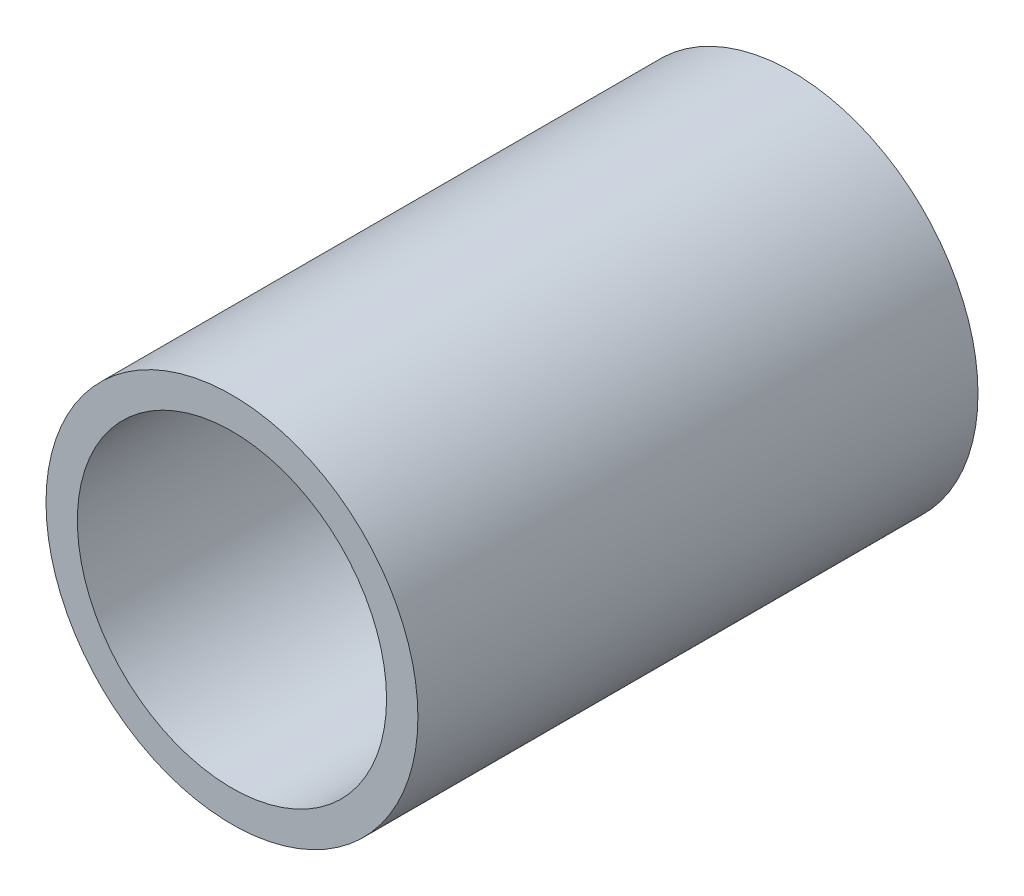
ISO-10303-21;
HEADER;
FILE_DESCRIPTION(('STEP AP214'),'2;1');
FILE_NAME('part.step','',(''),(''),'','','');
FILE_SCHEMA(('AUTOMOTIVE_DESIGN { 1 0 10303 214 1 1 1 1 }'));
ENDSEC;
DATA;
#1=APPLICATION_CONTEXT('core data for automotive mechanical design processes');
#2=APPLICATION_PROTOCOL_DEFINITION('international standard','automotive_design',2000,#1);
#3=PRODUCT_CONTEXT('',#1,'mechanical');
#4=PRODUCT('Part','Part','',(#3));
#5=PRODUCT_RELATED_PRODUCT_CATEGORY('part','',(#4));
#6=PRODUCT_DEFINITION_FORMATION('','',#4);
#7=PRODUCT_DEFINITION_CONTEXT('part definition',#1,'design');
#8=PRODUCT_DEFINITION('design','',#6,#7);
#9=PRODUCT_DEFINITION_SHAPE('','',#8);
#10=(LENGTH_UNIT() NAMED_UNIT(*) SI_UNIT(.MILLI.,.METRE.));
#11=(NAMED_UNIT(*) PLANE_ANGLE_UNIT() SI_UNIT($,.RADIAN.));
#12=(NAMED_UNIT(*) SI_UNIT($,.STERADIAN.) SOLID_ANGLE_UNIT());
#13=UNCERTAINTY_MEASURE_WITH_UNIT(LENGTH_MEASURE(1.E-05),#10,'distance_accuracy_value','');
#14=(GEOMETRIC_REPRESENTATION_CONTEXT(3) GLOBAL_UNCERTAINTY_ASSIGNED_CONTEXT((#13)) GLOBAL_UNIT_ASSIGNED_CONTEXT((#10,
#11,#12)) REPRESENTATION_CONTEXT('',''));
#15=CARTESIAN_POINT('',(0.,0.,0.));
#16=DIRECTION('',(0.,0.,1.));
#17=DIRECTION('',(1.,0.,0.));
#18=AXIS2_PLACEMENT_3D('',#15,#16,#17);
#19=CARTESIAN_POINT('',(0.,0.,63.5));
#20=DIRECTION('',(0.,0.,1.));
#21=DIRECTION('',(1.,0.,0.));
#22=AXIS2_PLACEMENT_3D('',#19,#20,#21);
#23=PLANE('',#22);
#24=CARTESIAN_POINT('',(0.,0.,63.5));
#25=DIRECTION('',(0.,0.,1.));
#26=DIRECTION('',(1.,0.,0.));
#27=AXIS2_PLACEMENT_3D('',#24,#25,#26);
#28=CIRCLE('',#27,21.082);
#29=CARTESIAN_POINT('',(21.082,0.,63.5));
#30=VERTEX_POINT('',#29);
#31=EDGE_CURVE('E12',#30,#30,#28,.T.);
#32=ORIENTED_EDGE('',*,*,#31,.T.);
#33=EDGE_LOOP('',(#32));
#34=FACE_BOUND('',#33,.T.);
#35=CARTESIAN_POINT('',(0.,0.,63.5));
#36=DIRECTION('',(0.,0.,1.));
#37=DIRECTION('',(1.,0.,0.));
#38=AXIS2_PLACEMENT_3D('',#35,#36,#37);
#39=CIRCLE('',#38,17.526);
#40=CARTESIAN_POINT('',(17.526,0.,63.5));
#41=VERTEX_POINT('',#40);
#42=EDGE_CURVE('E51',#41,#41,#39,.T.);
#43=ORIENTED_EDGE('',*,*,#42,.F.);
#44=EDGE_LOOP('',(#43));
#45=FACE_BOUND('',#44,.T.);
#46=ADVANCED_FACE('F40',(#34,#45),#23,.T.);
#47=CARTESIAN_POINT('',(0.,0.,0.));
#48=DIRECTION('',(0.,0.,1.));
#49=DIRECTION('',(1.,0.,0.));
#50=AXIS2_PLACEMENT_3D('',#47,#48,#49);
#51=PLANE('',#50);
#52=CARTESIAN_POINT('',(0.,0.,0.));
#53=DIRECTION('',(0.,0.,1.));
#54=DIRECTION('',(1.,0.,0.));
#55=AXIS2_PLACEMENT_3D('',#52,#53,#54);
#56=CIRCLE('',#55,21.082);
#57=CARTESIAN_POINT('',(21.082,0.,0.));
#58=VERTEX_POINT('',#57);
#59=EDGE_CURVE('E44',#58,#58,#56,.T.);
#60=ORIENTED_EDGE('',*,*,#59,.F.);
#61=EDGE_LOOP('',(#60));
#62=FACE_BOUND('',#61,.T.);
#63=CARTESIAN_POINT('',(0.,0.,0.));
#64=DIRECTION('',(0.,0.,1.));
#65=DIRECTION('',(1.,0.,0.));
#66=AXIS2_PLACEMENT_3D('',#63,#64,#65);
#67=CIRCLE('',#66,17.526);
#68=CARTESIAN_POINT('',(17.526,0.,0.));
#69=VERTEX_POINT('',#68);
#70=EDGE_CURVE('E53',#69,#69,#67,.T.);
#71=ORIENTED_EDGE('',*,*,#70,.T.);
#72=EDGE_LOOP('',(#71));
#73=FACE_BOUND('',#72,.T.);
#74=ADVANCED_FACE('F63',(#62,#73),#51,.F.);
#75=CARTESIAN_POINT('',(0.,0.,63.5));
#76=DIRECTION('',(0.,0.,-1.));
#77=DIRECTION('',(-1.,0.,0.));
#78=AXIS2_PLACEMENT_3D('',#75,#76,#77);
#79=CYLINDRICAL_SURFACE('',#78,21.082);
#80=ORIENTED_EDGE('',*,*,#31,.F.);
#81=EDGE_LOOP('',(#80));
#82=FACE_BOUND('',#81,.T.);
#83=ORIENTED_EDGE('',*,*,#59,.T.);
#84=EDGE_LOOP('',(#83));
#85=FACE_BOUND('',#84,.T.);
#86=ADVANCED_FACE('F42',(#82,#85),#79,.T.);
#87=CARTESIAN_POINT('',(0.,0.,63.5));
#88=DIRECTION('',(0.,0.,-1.));
#89=DIRECTION('',(-1.,0.,0.));
#90=AXIS2_PLACEMENT_3D('',#87,#88,#89);
#91=CYLINDRICAL_SURFACE('',#90,17.526);
#92=ORIENTED_EDGE('',*,*,#42,.T.);
#93=EDGE_LOOP('',(#92));
#94=FACE_BOUND('',#93,.T.);
#95=ORIENTED_EDGE('',*,*,#70,.F.);
#96=EDGE_LOOP('',(#95));
#97=FACE_BOUND('',#96,.T.);
#98=ADVANCED_FACE('F59',(#94,#97),#91,.F.);
#99=CLOSED_SHELL('',(#46,#74,#86,#98));
#100=MANIFOLD_SOLID_BREP('B2',#99);
#101=ADVANCED_BREP_SHAPE_REPRESENTATION('',(#18,#100),#14);
#102=SHAPE_DEFINITION_REPRESENTATION(#9,#101);
ENDSEC;
END-ISO-10303-21;
